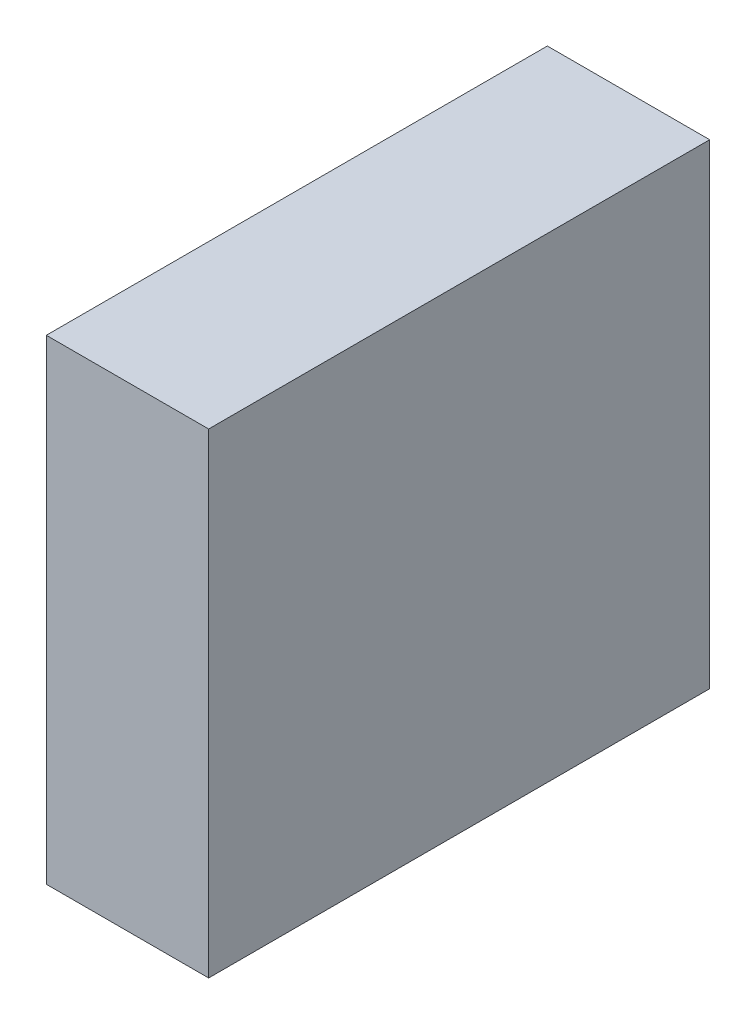
ISO-10303-21;
HEADER;
FILE_DESCRIPTION(('STEP AP214'),'2;1');
FILE_NAME('part.step','',(''),(''),'','','');
FILE_SCHEMA(('AUTOMOTIVE_DESIGN { 1 0 10303 214 1 1 1 1 }'));
ENDSEC;
DATA;
#1=APPLICATION_CONTEXT('core data for automotive mechanical design processes');
#2=APPLICATION_PROTOCOL_DEFINITION('international standard','automotive_design',2000,#1);
#3=PRODUCT_CONTEXT('',#1,'mechanical');
#4=PRODUCT('Part','Part','',(#3));
#5=PRODUCT_RELATED_PRODUCT_CATEGORY('part','',(#4));
#6=PRODUCT_DEFINITION_FORMATION('','',#4);
#7=PRODUCT_DEFINITION_CONTEXT('part definition',#1,'design');
#8=PRODUCT_DEFINITION('design','',#6,#7);
#9=PRODUCT_DEFINITION_SHAPE('','',#8);
#10=(LENGTH_UNIT() NAMED_UNIT(*) SI_UNIT(.MILLI.,.METRE.));
#11=(NAMED_UNIT(*) PLANE_ANGLE_UNIT() SI_UNIT($,.RADIAN.));
#12=(NAMED_UNIT(*) SI_UNIT($,.STERADIAN.) SOLID_ANGLE_UNIT());
#13=UNCERTAINTY_MEASURE_WITH_UNIT(LENGTH_MEASURE(1.E-05),#10,'distance_accuracy_value','');
#14=(GEOMETRIC_REPRESENTATION_CONTEXT(3) GLOBAL_UNCERTAINTY_ASSIGNED_CONTEXT((#13)) GLOBAL_UNIT_ASSIGNED_CONTEXT((#10,
#11,#12)) REPRESENTATION_CONTEXT('',''));
#15=CARTESIAN_POINT('',(0.,0.,0.));
#16=DIRECTION('',(0.,0.,1.));
#17=DIRECTION('',(1.,0.,0.));
#18=AXIS2_PLACEMENT_3D('',#15,#16,#17);
#19=CARTESIAN_POINT('',(-0.16199104,-0.47449232,0.));
#20=DIRECTION('',(-1.,0.,0.));
#21=DIRECTION('',(0.,0.,1.));
#22=AXIS2_PLACEMENT_3D('',#19,#20,#21);
#23=PLANE('',#22);
#24=DIRECTION('',(0.,0.,1.));
#25=VECTOR('',#24,1.);
#26=CARTESIAN_POINT('',(-0.16199104,0.47449232,0.));
#27=LINE('',#26,#25);
#28=CARTESIAN_POINT('',(-0.16199104,0.47449232,0.));
#29=VERTEX_POINT('',#28);
#30=CARTESIAN_POINT('',(-0.16199104,0.47449232,1.00000054));
#31=VERTEX_POINT('',#30);
#32=EDGE_CURVE('E20',#29,#31,#27,.T.);
#33=ORIENTED_EDGE('',*,*,#32,.F.);
#34=DIRECTION('',(0.,1.,0.));
#35=VECTOR('',#34,1.);
#36=CARTESIAN_POINT('',(-0.16199104,0.,0.));
#37=LINE('',#36,#35);
#38=CARTESIAN_POINT('',(-0.16199104,-0.47449232,0.));
#39=VERTEX_POINT('',#38);
#40=EDGE_CURVE('E80',#39,#29,#37,.T.);
#41=ORIENTED_EDGE('',*,*,#40,.F.);
#42=DIRECTION('',(0.,0.,-1.));
#43=VECTOR('',#42,1.);
#44=CARTESIAN_POINT('',(-0.16199104,-0.47449232,0.));
#45=LINE('',#44,#43);
#46=CARTESIAN_POINT('',(-0.16199104,-0.47449232,1.00000054));
#47=VERTEX_POINT('',#46);
#48=EDGE_CURVE('E61',#47,#39,#45,.T.);
#49=ORIENTED_EDGE('',*,*,#48,.F.);
#50=DIRECTION('',(0.,1.,0.));
#51=VECTOR('',#50,1.);
#52=CARTESIAN_POINT('',(-0.16199104,0.,1.00000054));
#53=LINE('',#52,#51);
#54=EDGE_CURVE('E55',#47,#31,#53,.T.);
#55=ORIENTED_EDGE('',*,*,#54,.T.);
#56=EDGE_LOOP('',(#33,#41,#49,#55));
#57=FACE_BOUND('',#56,.T.);
#58=ADVANCED_FACE('F17',(#57),#23,.T.);
#59=CARTESIAN_POINT('',(-0.16199104,0.47449232,0.));
#60=DIRECTION('',(0.,1.,0.));
#61=DIRECTION('',(0.,0.,1.));
#62=AXIS2_PLACEMENT_3D('',#59,#60,#61);
#63=PLANE('',#62);
#64=DIRECTION('',(0.,0.,-1.));
#65=VECTOR('',#64,1.);
#66=CARTESIAN_POINT('',(0.16199358,0.47449232,0.));
#67=LINE('',#66,#65);
#68=CARTESIAN_POINT('',(0.16199358,0.47449232,0.));
#69=VERTEX_POINT('',#68);
#70=CARTESIAN_POINT('',(0.16199358,0.47449232,1.00000054));
#71=VERTEX_POINT('',#70);
#72=EDGE_CURVE('E83',#69,#71,#67,.F.);
#73=ORIENTED_EDGE('',*,*,#72,.F.);
#74=DIRECTION('',(-1.,0.,0.));
#75=VECTOR('',#74,1.);
#76=CARTESIAN_POINT('',(1.269999994944E-06,0.47449232,0.));
#77=LINE('',#76,#75);
#78=EDGE_CURVE('E68',#29,#69,#77,.F.);
#79=ORIENTED_EDGE('',*,*,#78,.F.);
#80=ORIENTED_EDGE('',*,*,#32,.T.);
#81=DIRECTION('',(-1.,0.,0.));
#82=VECTOR('',#81,1.);
#83=CARTESIAN_POINT('',(1.269999994944E-06,0.47449232,1.00000054));
#84=LINE('',#83,#82);
#85=EDGE_CURVE('E63',#31,#71,#84,.F.);
#86=ORIENTED_EDGE('',*,*,#85,.T.);
#87=EDGE_LOOP('',(#73,#79,#80,#86));
#88=FACE_BOUND('',#87,.T.);
#89=ADVANCED_FACE('F65',(#88),#63,.T.);
#90=CARTESIAN_POINT('',(1.269999994944E-06,0.,1.00000054));
#91=DIRECTION('',(0.,0.,-1.));
#92=DIRECTION('',(-1.,0.,0.));
#93=AXIS2_PLACEMENT_3D('',#90,#91,#92);
#94=PLANE('',#93);
#95=ORIENTED_EDGE('',*,*,#54,.F.);
#96=DIRECTION('',(1.,0.,0.));
#97=VECTOR('',#96,1.);
#98=CARTESIAN_POINT('',(0.16199358,-0.47449232,1.00000054));
#99=LINE('',#98,#97);
#100=CARTESIAN_POINT('',(0.16199358,-0.47449232,1.00000054));
#101=VERTEX_POINT('',#100);
#102=EDGE_CURVE('E74',#101,#47,#99,.F.);
#103=ORIENTED_EDGE('',*,*,#102,.F.);
#104=DIRECTION('',(0.,1.,0.));
#105=VECTOR('',#104,1.);
#106=CARTESIAN_POINT('',(0.16199358,0.47449232,1.00000054));
#107=LINE('',#106,#105);
#108=EDGE_CURVE('E72',#71,#101,#107,.F.);
#109=ORIENTED_EDGE('',*,*,#108,.F.);
#110=ORIENTED_EDGE('',*,*,#85,.F.);
#111=EDGE_LOOP('',(#95,#103,#109,#110));
#112=FACE_BOUND('',#111,.T.);
#113=ADVANCED_FACE('F70',(#112),#94,.F.);
#114=CARTESIAN_POINT('',(0.16199358,-0.47449232,0.));
#115=DIRECTION('',(0.,-1.,0.));
#116=DIRECTION('',(0.,0.,-1.));
#117=AXIS2_PLACEMENT_3D('',#114,#115,#116);
#118=PLANE('',#117);
#119=ORIENTED_EDGE('',*,*,#48,.T.);
#120=DIRECTION('',(-1.,0.,0.));
#121=VECTOR('',#120,1.);
#122=CARTESIAN_POINT('',(1.269999994944E-06,-0.47449232,0.));
#123=LINE('',#122,#121);
#124=CARTESIAN_POINT('',(0.16199358,-0.47449232,0.));
#125=VERTEX_POINT('',#124);
#126=EDGE_CURVE('E35',#125,#39,#123,.T.);
#127=ORIENTED_EDGE('',*,*,#126,.F.);
#128=DIRECTION('',(0.,0.,-1.));
#129=VECTOR('',#128,1.);
#130=CARTESIAN_POINT('',(0.16199358,-0.47449232,0.));
#131=LINE('',#130,#129);
#132=EDGE_CURVE('E26',#101,#125,#131,.T.);
#133=ORIENTED_EDGE('',*,*,#132,.F.);
#134=ORIENTED_EDGE('',*,*,#102,.T.);
#135=EDGE_LOOP('',(#119,#127,#133,#134));
#136=FACE_BOUND('',#135,.T.);
#137=ADVANCED_FACE('F89',(#136),#118,.T.);
#138=CARTESIAN_POINT('',(1.269999994944E-06,0.,0.));
#139=DIRECTION('',(0.,0.,-1.));
#140=DIRECTION('',(-1.,0.,0.));
#141=AXIS2_PLACEMENT_3D('',#138,#139,#140);
#142=PLANE('',#141);
#143=ORIENTED_EDGE('',*,*,#40,.T.);
#144=ORIENTED_EDGE('',*,*,#78,.T.);
#145=DIRECTION('',(0.,1.,0.));
#146=VECTOR('',#145,1.);
#147=CARTESIAN_POINT('',(0.16199358,0.47449232,0.));
#148=LINE('',#147,#146);
#149=EDGE_CURVE('E11',#125,#69,#148,.T.);
#150=ORIENTED_EDGE('',*,*,#149,.F.);
#151=ORIENTED_EDGE('',*,*,#126,.T.);
#152=EDGE_LOOP('',(#143,#144,#150,#151));
#153=FACE_BOUND('',#152,.T.);
#154=ADVANCED_FACE('F91',(#153),#142,.T.);
#155=CARTESIAN_POINT('',(0.16199358,0.47449232,0.));
#156=DIRECTION('',(1.,0.,0.));
#157=DIRECTION('',(0.,0.,-1.));
#158=AXIS2_PLACEMENT_3D('',#155,#156,#157);
#159=PLANE('',#158);
#160=ORIENTED_EDGE('',*,*,#132,.T.);
#161=ORIENTED_EDGE('',*,*,#149,.T.);
#162=ORIENTED_EDGE('',*,*,#72,.T.);
#163=ORIENTED_EDGE('',*,*,#108,.T.);
#164=EDGE_LOOP('',(#160,#161,#162,#163));
#165=FACE_BOUND('',#164,.T.);
#166=ADVANCED_FACE('F88',(#165),#159,.T.);
#167=CLOSED_SHELL('',(#58,#89,#113,#137,#154,#166));
#168=MANIFOLD_SOLID_BREP('B1',#167);
#169=ADVANCED_BREP_SHAPE_REPRESENTATION('',(#18,#168),#14);
#170=SHAPE_DEFINITION_REPRESENTATION(#9,#169);
ENDSEC;
END-ISO-10303-21;
